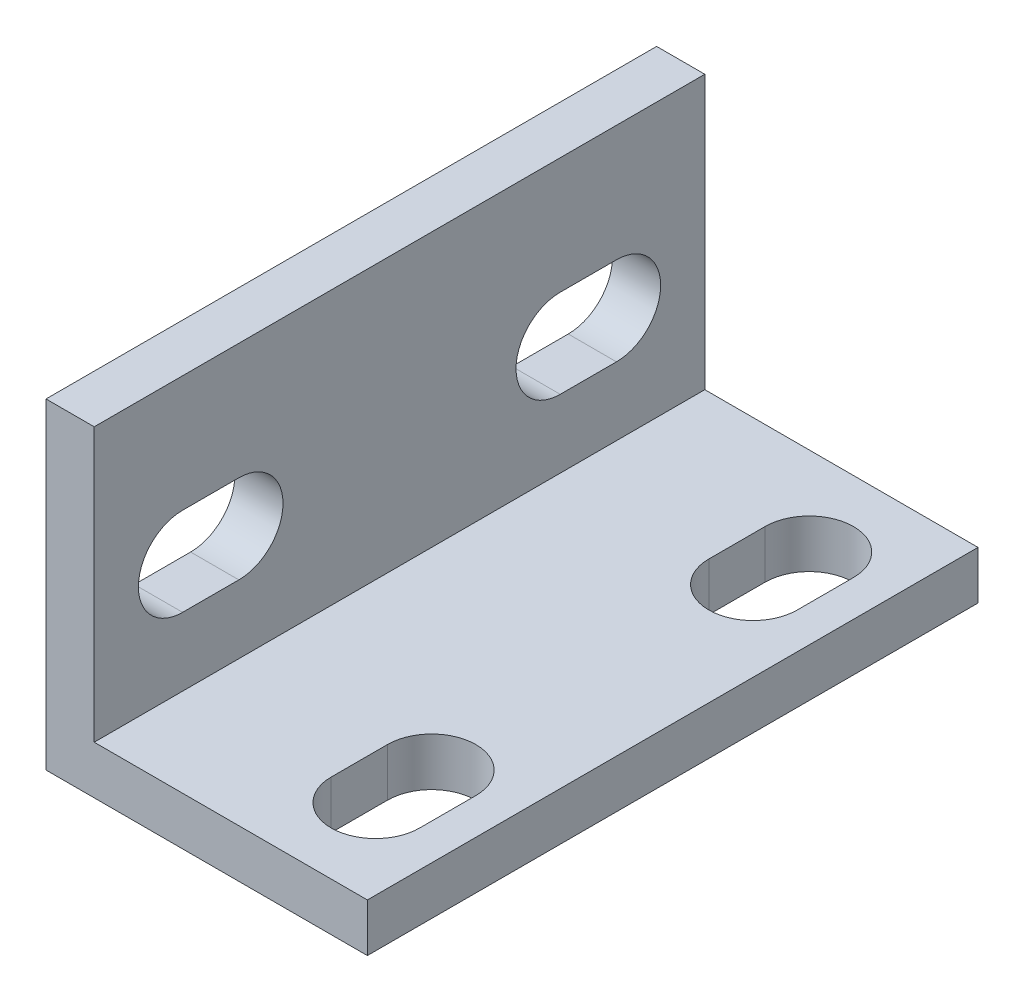
ISO-10303-21;
HEADER;
FILE_DESCRIPTION(('STEP AP214'),'2;1');
FILE_NAME('part.step','',(''),(''),'','','');
FILE_SCHEMA(('AUTOMOTIVE_DESIGN { 1 0 10303 214 1 1 1 1 }'));
ENDSEC;
DATA;
#1=APPLICATION_CONTEXT('core data for automotive mechanical design processes');
#2=APPLICATION_PROTOCOL_DEFINITION('international standard','automotive_design',2000,#1);
#3=PRODUCT_CONTEXT('',#1,'mechanical');
#4=PRODUCT('Part','Part','',(#3));
#5=PRODUCT_RELATED_PRODUCT_CATEGORY('part','',(#4));
#6=PRODUCT_DEFINITION_FORMATION('','',#4);
#7=PRODUCT_DEFINITION_CONTEXT('part definition',#1,'design');
#8=PRODUCT_DEFINITION('design','',#6,#7);
#9=PRODUCT_DEFINITION_SHAPE('','',#8);
#10=(LENGTH_UNIT() NAMED_UNIT(*) SI_UNIT(.MILLI.,.METRE.));
#11=(NAMED_UNIT(*) PLANE_ANGLE_UNIT() SI_UNIT($,.RADIAN.));
#12=(NAMED_UNIT(*) SI_UNIT($,.STERADIAN.) SOLID_ANGLE_UNIT());
#13=UNCERTAINTY_MEASURE_WITH_UNIT(LENGTH_MEASURE(1.E-05),#10,'distance_accuracy_value','');
#14=(GEOMETRIC_REPRESENTATION_CONTEXT(3) GLOBAL_UNCERTAINTY_ASSIGNED_CONTEXT((#13)) GLOBAL_UNIT_ASSIGNED_CONTEXT((#10,
#11,#12)) REPRESENTATION_CONTEXT('',''));
#15=CARTESIAN_POINT('',(0.,0.,0.));
#16=DIRECTION('',(0.,0.,1.));
#17=DIRECTION('',(1.,0.,0.));
#18=AXIS2_PLACEMENT_3D('',#15,#16,#17);
#19=CARTESIAN_POINT('',(0.,0.,38.));
#20=DIRECTION('',(0.,1.,0.));
#21=DIRECTION('',(0.,0.,1.));
#22=AXIS2_PLACEMENT_3D('',#19,#20,#21);
#23=PLANE('',#22);
#24=DIRECTION('',(0.,0.,-1.));
#25=VECTOR('',#24,1.);
#26=CARTESIAN_POINT('',(17.75,0.,5.49999999999999));
#27=LINE('',#26,#25);
#28=CARTESIAN_POINT('',(17.75,0.,9.));
#29=VERTEX_POINT('',#28);
#30=CARTESIAN_POINT('',(17.75,0.,5.49999999999999));
#31=VERTEX_POINT('',#30);
#32=EDGE_CURVE('E190',#29,#31,#27,.T.);
#33=ORIENTED_EDGE('',*,*,#32,.T.);
#34=CARTESIAN_POINT('',(15.,0.,5.49999999999999));
#35=DIRECTION('',(0.,1.,0.));
#36=DIRECTION('',(0.,0.,-1.));
#37=AXIS2_PLACEMENT_3D('',#34,#35,#36);
#38=CIRCLE('',#37,2.75000000000001);
#39=CARTESIAN_POINT('',(12.25,0.,5.49999999999999));
#40=VERTEX_POINT('',#39);
#41=EDGE_CURVE('E184',#31,#40,#38,.T.);
#42=ORIENTED_EDGE('',*,*,#41,.T.);
#43=DIRECTION('',(0.,0.,1.));
#44=VECTOR('',#43,1.);
#45=CARTESIAN_POINT('',(12.25,0.,5.49999999999999));
#46=LINE('',#45,#44);
#47=CARTESIAN_POINT('',(12.25,0.,9.));
#48=VERTEX_POINT('',#47);
#49=EDGE_CURVE('E193',#40,#48,#46,.T.);
#50=ORIENTED_EDGE('',*,*,#49,.T.);
#51=CARTESIAN_POINT('',(15.,0.,9.));
#52=DIRECTION('',(0.,1.,0.));
#53=DIRECTION('',(0.,0.,-1.));
#54=AXIS2_PLACEMENT_3D('',#51,#52,#53);
#55=CIRCLE('',#54,2.75000000000001);
#56=EDGE_CURVE('E49',#48,#29,#55,.T.);
#57=ORIENTED_EDGE('',*,*,#56,.T.);
#58=EDGE_LOOP('',(#33,#42,#50,#57));
#59=FACE_BOUND('',#58,.T.);
#60=DIRECTION('',(0.,0.,1.));
#61=VECTOR('',#60,1.);
#62=CARTESIAN_POINT('',(12.25,0.,32.5));
#63=LINE('',#62,#61);
#64=CARTESIAN_POINT('',(12.25,0.,29.));
#65=VERTEX_POINT('',#64);
#66=CARTESIAN_POINT('',(12.25,0.,32.5));
#67=VERTEX_POINT('',#66);
#68=EDGE_CURVE('E228',#65,#67,#63,.T.);
#69=ORIENTED_EDGE('',*,*,#68,.T.);
#70=CARTESIAN_POINT('',(15.,0.,32.5));
#71=DIRECTION('',(0.,1.,0.));
#72=DIRECTION('',(0.,0.,1.));
#73=AXIS2_PLACEMENT_3D('',#70,#71,#72);
#74=CIRCLE('',#73,2.75);
#75=CARTESIAN_POINT('',(17.75,0.,32.5));
#76=VERTEX_POINT('',#75);
#77=EDGE_CURVE('E218',#67,#76,#74,.T.);
#78=ORIENTED_EDGE('',*,*,#77,.T.);
#79=DIRECTION('',(0.,0.,-1.));
#80=VECTOR('',#79,1.);
#81=CARTESIAN_POINT('',(17.75,0.,32.5));
#82=LINE('',#81,#80);
#83=CARTESIAN_POINT('',(17.75,0.,29.));
#84=VERTEX_POINT('',#83);
#85=EDGE_CURVE('E221',#76,#84,#82,.T.);
#86=ORIENTED_EDGE('',*,*,#85,.T.);
#87=CARTESIAN_POINT('',(15.,0.,29.));
#88=DIRECTION('',(0.,1.,0.));
#89=DIRECTION('',(0.,0.,1.));
#90=AXIS2_PLACEMENT_3D('',#87,#88,#89);
#91=CIRCLE('',#90,2.75000000000001);
#92=EDGE_CURVE('E225',#84,#65,#91,.T.);
#93=ORIENTED_EDGE('',*,*,#92,.T.);
#94=EDGE_LOOP('',(#69,#78,#86,#93));
#95=FACE_BOUND('',#94,.T.);
#96=DIRECTION('',(1.,0.,0.));
#97=VECTOR('',#96,1.);
#98=CARTESIAN_POINT('',(0.,0.,0.));
#99=LINE('',#98,#97);
#100=CARTESIAN_POINT('',(0.,0.,0.));
#101=VERTEX_POINT('',#100);
#102=CARTESIAN_POINT('',(20.,0.,0.));
#103=VERTEX_POINT('',#102);
#104=EDGE_CURVE('E307',#101,#103,#99,.T.);
#105=ORIENTED_EDGE('',*,*,#104,.T.);
#106=DIRECTION('',(0.,0.,-1.));
#107=VECTOR('',#106,1.);
#108=CARTESIAN_POINT('',(20.,0.,38.));
#109=LINE('',#108,#107);
#110=CARTESIAN_POINT('',(20.,0.,38.));
#111=VERTEX_POINT('',#110);
#112=EDGE_CURVE('E11',#111,#103,#109,.T.);
#113=ORIENTED_EDGE('',*,*,#112,.F.);
#114=DIRECTION('',(1.,0.,0.));
#115=VECTOR('',#114,1.);
#116=CARTESIAN_POINT('',(0.,0.,38.));
#117=LINE('',#116,#115);
#118=CARTESIAN_POINT('',(0.,0.,38.));
#119=VERTEX_POINT('',#118);
#120=EDGE_CURVE('E314',#119,#111,#117,.T.);
#121=ORIENTED_EDGE('',*,*,#120,.F.);
#122=DIRECTION('',(0.,0.,-1.));
#123=VECTOR('',#122,1.);
#124=CARTESIAN_POINT('',(0.,0.,38.));
#125=LINE('',#124,#123);
#126=EDGE_CURVE('E331',#119,#101,#125,.T.);
#127=ORIENTED_EDGE('',*,*,#126,.T.);
#128=EDGE_LOOP('',(#105,#113,#121,#127));
#129=FACE_BOUND('',#128,.T.);
#130=ADVANCED_FACE('F35',(#59,#95,#129),#23,.F.);
#131=CARTESIAN_POINT('',(20.,3.,38.));
#132=DIRECTION('',(1.,0.,0.));
#133=DIRECTION('',(0.,0.,-1.));
#134=AXIS2_PLACEMENT_3D('',#131,#132,#133);
#135=PLANE('',#134);
#136=DIRECTION('',(0.,-1.,0.));
#137=VECTOR('',#136,1.);
#138=CARTESIAN_POINT('',(20.,3.,0.));
#139=LINE('',#138,#137);
#140=CARTESIAN_POINT('',(20.,3.,0.));
#141=VERTEX_POINT('',#140);
#142=EDGE_CURVE('E334',#141,#103,#139,.T.);
#143=ORIENTED_EDGE('',*,*,#142,.F.);
#144=DIRECTION('',(0.,0.,-1.));
#145=VECTOR('',#144,1.);
#146=CARTESIAN_POINT('',(20.,3.,38.));
#147=LINE('',#146,#145);
#148=CARTESIAN_POINT('',(20.,3.,38.));
#149=VERTEX_POINT('',#148);
#150=EDGE_CURVE('E42',#149,#141,#147,.T.);
#151=ORIENTED_EDGE('',*,*,#150,.F.);
#152=DIRECTION('',(0.,-1.,0.));
#153=VECTOR('',#152,1.);
#154=CARTESIAN_POINT('',(20.,3.,38.));
#155=LINE('',#154,#153);
#156=EDGE_CURVE('E316',#149,#111,#155,.T.);
#157=ORIENTED_EDGE('',*,*,#156,.T.);
#158=ORIENTED_EDGE('',*,*,#112,.T.);
#159=EDGE_LOOP('',(#143,#151,#157,#158));
#160=FACE_BOUND('',#159,.T.);
#161=ADVANCED_FACE('F361',(#160),#135,.T.);
#162=CARTESIAN_POINT('',(0.,3.,38.));
#163=DIRECTION('',(0.,1.,0.));
#164=DIRECTION('',(0.,0.,1.));
#165=AXIS2_PLACEMENT_3D('',#162,#163,#164);
#166=PLANE('',#165);
#167=CARTESIAN_POINT('',(15.,3.,5.49999999999999));
#168=DIRECTION('',(0.,1.,0.));
#169=DIRECTION('',(0.,0.,-1.));
#170=AXIS2_PLACEMENT_3D('',#167,#168,#169);
#171=CIRCLE('',#170,2.75000000000001);
#172=CARTESIAN_POINT('',(17.75,3.,5.49999999999999));
#173=VERTEX_POINT('',#172);
#174=CARTESIAN_POINT('',(12.25,3.,5.5));
#175=VERTEX_POINT('',#174);
#176=EDGE_CURVE('E57',#173,#175,#171,.T.);
#177=ORIENTED_EDGE('',*,*,#176,.F.);
#178=DIRECTION('',(0.,0.,-1.));
#179=VECTOR('',#178,1.);
#180=CARTESIAN_POINT('',(17.75,3.,5.49999999999999));
#181=LINE('',#180,#179);
#182=CARTESIAN_POINT('',(17.75,3.,9.));
#183=VERTEX_POINT('',#182);
#184=EDGE_CURVE('E199',#183,#173,#181,.T.);
#185=ORIENTED_EDGE('',*,*,#184,.F.);
#186=CARTESIAN_POINT('',(15.,3.,9.));
#187=DIRECTION('',(0.,1.,0.));
#188=DIRECTION('',(0.,0.,-1.));
#189=AXIS2_PLACEMENT_3D('',#186,#187,#188);
#190=CIRCLE('',#189,2.75000000000001);
#191=CARTESIAN_POINT('',(12.25,3.,9.));
#192=VERTEX_POINT('',#191);
#193=EDGE_CURVE('E202',#192,#183,#190,.T.);
#194=ORIENTED_EDGE('',*,*,#193,.F.);
#195=DIRECTION('',(0.,0.,1.));
#196=VECTOR('',#195,1.);
#197=CARTESIAN_POINT('',(12.25,3.,5.49999999999999));
#198=LINE('',#197,#196);
#199=EDGE_CURVE('E208',#175,#192,#198,.T.);
#200=ORIENTED_EDGE('',*,*,#199,.F.);
#201=EDGE_LOOP('',(#177,#185,#194,#200));
#202=FACE_BOUND('',#201,.T.);
#203=CARTESIAN_POINT('',(15.,3.,32.5));
#204=DIRECTION('',(0.,1.,0.));
#205=DIRECTION('',(0.,0.,1.));
#206=AXIS2_PLACEMENT_3D('',#203,#204,#205);
#207=CIRCLE('',#206,2.75);
#208=CARTESIAN_POINT('',(12.25,3.,32.5));
#209=VERTEX_POINT('',#208);
#210=CARTESIAN_POINT('',(17.75,3.,32.5));
#211=VERTEX_POINT('',#210);
#212=EDGE_CURVE('E214',#209,#211,#207,.T.);
#213=ORIENTED_EDGE('',*,*,#212,.F.);
#214=DIRECTION('',(0.,0.,1.));
#215=VECTOR('',#214,1.);
#216=CARTESIAN_POINT('',(12.25,3.,32.5));
#217=LINE('',#216,#215);
#218=CARTESIAN_POINT('',(12.25,3.,29.));
#219=VERTEX_POINT('',#218);
#220=EDGE_CURVE('E222',#219,#209,#217,.T.);
#221=ORIENTED_EDGE('',*,*,#220,.F.);
#222=CARTESIAN_POINT('',(15.,3.,29.));
#223=DIRECTION('',(0.,1.,0.));
#224=DIRECTION('',(0.,0.,1.));
#225=AXIS2_PLACEMENT_3D('',#222,#223,#224);
#226=CIRCLE('',#225,2.75000000000001);
#227=CARTESIAN_POINT('',(17.75,3.,29.));
#228=VERTEX_POINT('',#227);
#229=EDGE_CURVE('E236',#228,#219,#226,.T.);
#230=ORIENTED_EDGE('',*,*,#229,.F.);
#231=DIRECTION('',(0.,0.,-1.));
#232=VECTOR('',#231,1.);
#233=CARTESIAN_POINT('',(17.75,3.,32.5));
#234=LINE('',#233,#232);
#235=EDGE_CURVE('E233',#211,#228,#234,.T.);
#236=ORIENTED_EDGE('',*,*,#235,.F.);
#237=EDGE_LOOP('',(#213,#221,#230,#236));
#238=FACE_BOUND('',#237,.T.);
#239=DIRECTION('',(1.,0.,0.));
#240=VECTOR('',#239,1.);
#241=CARTESIAN_POINT('',(0.,3.,0.));
#242=LINE('',#241,#240);
#243=CARTESIAN_POINT('',(3.,3.,0.));
#244=VERTEX_POINT('',#243);
#245=EDGE_CURVE('E337',#244,#141,#242,.T.);
#246=ORIENTED_EDGE('',*,*,#245,.F.);
#247=DIRECTION('',(0.,0.,-1.));
#248=VECTOR('',#247,1.);
#249=CARTESIAN_POINT('',(3.,3.,38.));
#250=LINE('',#249,#248);
#251=CARTESIAN_POINT('',(3.,3.,38.));
#252=VERTEX_POINT('',#251);
#253=EDGE_CURVE('E353',#252,#244,#250,.T.);
#254=ORIENTED_EDGE('',*,*,#253,.F.);
#255=DIRECTION('',(1.,0.,0.));
#256=VECTOR('',#255,1.);
#257=CARTESIAN_POINT('',(0.,3.,38.));
#258=LINE('',#257,#256);
#259=EDGE_CURVE('E320',#252,#149,#258,.T.);
#260=ORIENTED_EDGE('',*,*,#259,.T.);
#261=ORIENTED_EDGE('',*,*,#150,.T.);
#262=EDGE_LOOP('',(#246,#254,#260,#261));
#263=FACE_BOUND('',#262,.T.);
#264=ADVANCED_FACE('F357',(#202,#238,#263),#166,.T.);
#265=CARTESIAN_POINT('',(3.,20.,38.));
#266=DIRECTION('',(1.,0.,0.));
#267=DIRECTION('',(0.,0.,-1.));
#268=AXIS2_PLACEMENT_3D('',#265,#266,#267);
#269=PLANE('',#268);
#270=CARTESIAN_POINT('',(3.,10.,9.00000000000001));
#271=DIRECTION('',(1.,0.,0.));
#272=DIRECTION('',(0.,0.,1.));
#273=AXIS2_PLACEMENT_3D('',#270,#271,#272);
#274=CIRCLE('',#273,2.75);
#275=CARTESIAN_POINT('',(3.,12.75,9.00000000000001));
#276=VERTEX_POINT('',#275);
#277=CARTESIAN_POINT('',(3.,7.25,9.));
#278=VERTEX_POINT('',#277);
#279=EDGE_CURVE('E243',#276,#278,#274,.T.);
#280=ORIENTED_EDGE('',*,*,#279,.F.);
#281=DIRECTION('',(0.,0.,1.));
#282=VECTOR('',#281,1.);
#283=CARTESIAN_POINT('',(3.,12.75,9.00000000000001));
#284=LINE('',#283,#282);
#285=CARTESIAN_POINT('',(3.,12.75,5.5));
#286=VERTEX_POINT('',#285);
#287=EDGE_CURVE('E254',#286,#276,#284,.T.);
#288=ORIENTED_EDGE('',*,*,#287,.F.);
#289=CARTESIAN_POINT('',(3.,10.,5.5));
#290=DIRECTION('',(1.,0.,0.));
#291=DIRECTION('',(0.,0.,1.));
#292=AXIS2_PLACEMENT_3D('',#289,#290,#291);
#293=CIRCLE('',#292,2.75);
#294=CARTESIAN_POINT('',(3.,7.25,5.5));
#295=VERTEX_POINT('',#294);
#296=EDGE_CURVE('E268',#295,#286,#293,.T.);
#297=ORIENTED_EDGE('',*,*,#296,.F.);
#298=DIRECTION('',(0.,0.,-1.));
#299=VECTOR('',#298,1.);
#300=CARTESIAN_POINT('',(3.,7.25,9.00000000000001));
#301=LINE('',#300,#299);
#302=EDGE_CURVE('E265',#278,#295,#301,.T.);
#303=ORIENTED_EDGE('',*,*,#302,.F.);
#304=EDGE_LOOP('',(#280,#288,#297,#303));
#305=FACE_BOUND('',#304,.T.);
#306=CARTESIAN_POINT('',(3.,10.,29.));
#307=DIRECTION('',(1.,0.,0.));
#308=DIRECTION('',(0.,0.,-1.));
#309=AXIS2_PLACEMENT_3D('',#306,#307,#308);
#310=CIRCLE('',#309,2.75);
#311=CARTESIAN_POINT('',(3.,7.25,29.));
#312=VERTEX_POINT('',#311);
#313=CARTESIAN_POINT('',(3.,12.75,29.));
#314=VERTEX_POINT('',#313);
#315=EDGE_CURVE('E275',#312,#314,#310,.T.);
#316=ORIENTED_EDGE('',*,*,#315,.F.);
#317=DIRECTION('',(0.,0.,-1.));
#318=VECTOR('',#317,1.);
#319=CARTESIAN_POINT('',(3.,7.25,29.));
#320=LINE('',#319,#318);
#321=CARTESIAN_POINT('',(3.,7.25,32.5));
#322=VERTEX_POINT('',#321);
#323=EDGE_CURVE('E286',#322,#312,#320,.T.);
#324=ORIENTED_EDGE('',*,*,#323,.F.);
#325=CARTESIAN_POINT('',(3.,10.,32.5));
#326=DIRECTION('',(1.,0.,0.));
#327=DIRECTION('',(0.,0.,-1.));
#328=AXIS2_PLACEMENT_3D('',#325,#326,#327);
#329=CIRCLE('',#328,2.75);
#330=CARTESIAN_POINT('',(3.,12.75,32.5));
#331=VERTEX_POINT('',#330);
#332=EDGE_CURVE('E300',#331,#322,#329,.T.);
#333=ORIENTED_EDGE('',*,*,#332,.F.);
#334=DIRECTION('',(0.,0.,1.));
#335=VECTOR('',#334,1.);
#336=CARTESIAN_POINT('',(3.,12.75,29.));
#337=LINE('',#336,#335);
#338=EDGE_CURVE('E297',#314,#331,#337,.T.);
#339=ORIENTED_EDGE('',*,*,#338,.F.);
#340=EDGE_LOOP('',(#316,#324,#333,#339));
#341=FACE_BOUND('',#340,.T.);
#342=DIRECTION('',(0.,1.,0.));
#343=VECTOR('',#342,1.);
#344=CARTESIAN_POINT('',(3.,20.,0.));
#345=LINE('',#344,#343);
#346=CARTESIAN_POINT('',(3.,20.,0.));
#347=VERTEX_POINT('',#346);
#348=EDGE_CURVE('E340',#347,#244,#345,.F.);
#349=ORIENTED_EDGE('',*,*,#348,.F.);
#350=DIRECTION('',(0.,0.,-1.));
#351=VECTOR('',#350,1.);
#352=CARTESIAN_POINT('',(3.,20.,38.));
#353=LINE('',#352,#351);
#354=CARTESIAN_POINT('',(3.,20.,38.));
#355=VERTEX_POINT('',#354);
#356=EDGE_CURVE('E351',#355,#347,#353,.T.);
#357=ORIENTED_EDGE('',*,*,#356,.F.);
#358=DIRECTION('',(0.,1.,0.));
#359=VECTOR('',#358,1.);
#360=CARTESIAN_POINT('',(3.,20.,38.));
#361=LINE('',#360,#359);
#362=EDGE_CURVE('E323',#355,#252,#361,.F.);
#363=ORIENTED_EDGE('',*,*,#362,.T.);
#364=ORIENTED_EDGE('',*,*,#253,.T.);
#365=EDGE_LOOP('',(#349,#357,#363,#364));
#366=FACE_BOUND('',#365,.T.);
#367=ADVANCED_FACE('F370',(#305,#341,#366),#269,.T.);
#368=CARTESIAN_POINT('',(0.,20.,38.));
#369=DIRECTION('',(0.,1.,0.));
#370=DIRECTION('',(0.,0.,1.));
#371=AXIS2_PLACEMENT_3D('',#368,#369,#370);
#372=PLANE('',#371);
#373=DIRECTION('',(1.,0.,0.));
#374=VECTOR('',#373,1.);
#375=CARTESIAN_POINT('',(0.,20.,0.));
#376=LINE('',#375,#374);
#377=CARTESIAN_POINT('',(0.,20.,0.));
#378=VERTEX_POINT('',#377);
#379=EDGE_CURVE('E343',#378,#347,#376,.T.);
#380=ORIENTED_EDGE('',*,*,#379,.F.);
#381=DIRECTION('',(0.,0.,-1.));
#382=VECTOR('',#381,1.);
#383=CARTESIAN_POINT('',(0.,20.,38.));
#384=LINE('',#383,#382);
#385=CARTESIAN_POINT('',(0.,20.,38.));
#386=VERTEX_POINT('',#385);
#387=EDGE_CURVE('E349',#386,#378,#384,.T.);
#388=ORIENTED_EDGE('',*,*,#387,.F.);
#389=DIRECTION('',(1.,0.,0.));
#390=VECTOR('',#389,1.);
#391=CARTESIAN_POINT('',(0.,20.,38.));
#392=LINE('',#391,#390);
#393=EDGE_CURVE('E326',#386,#355,#392,.T.);
#394=ORIENTED_EDGE('',*,*,#393,.T.);
#395=ORIENTED_EDGE('',*,*,#356,.T.);
#396=EDGE_LOOP('',(#380,#388,#394,#395));
#397=FACE_BOUND('',#396,.T.);
#398=ADVANCED_FACE('F381',(#397),#372,.T.);
#399=CARTESIAN_POINT('',(0.,20.,38.));
#400=DIRECTION('',(1.,0.,0.));
#401=DIRECTION('',(0.,0.,-1.));
#402=AXIS2_PLACEMENT_3D('',#399,#400,#401);
#403=PLANE('',#402);
#404=DIRECTION('',(0.,0.,1.));
#405=VECTOR('',#404,1.);
#406=CARTESIAN_POINT('',(0.,12.75,9.00000000000001));
#407=LINE('',#406,#405);
#408=CARTESIAN_POINT('',(0.,12.75,5.5));
#409=VERTEX_POINT('',#408);
#410=CARTESIAN_POINT('',(0.,12.75,9.00000000000001));
#411=VERTEX_POINT('',#410);
#412=EDGE_CURVE('E260',#409,#411,#407,.T.);
#413=ORIENTED_EDGE('',*,*,#412,.T.);
#414=CARTESIAN_POINT('',(0.,10.,9.00000000000001));
#415=DIRECTION('',(1.,0.,0.));
#416=DIRECTION('',(0.,0.,1.));
#417=AXIS2_PLACEMENT_3D('',#414,#415,#416);
#418=CIRCLE('',#417,2.75);
#419=CARTESIAN_POINT('',(0.,7.25,9.00000000000001));
#420=VERTEX_POINT('',#419);
#421=EDGE_CURVE('E250',#411,#420,#418,.T.);
#422=ORIENTED_EDGE('',*,*,#421,.T.);
#423=DIRECTION('',(0.,0.,-1.));
#424=VECTOR('',#423,1.);
#425=CARTESIAN_POINT('',(0.,7.25,9.00000000000001));
#426=LINE('',#425,#424);
#427=CARTESIAN_POINT('',(0.,7.25,5.50000000000001));
#428=VERTEX_POINT('',#427);
#429=EDGE_CURVE('E253',#420,#428,#426,.T.);
#430=ORIENTED_EDGE('',*,*,#429,.T.);
#431=CARTESIAN_POINT('',(0.,10.,5.5));
#432=DIRECTION('',(1.,0.,0.));
#433=DIRECTION('',(0.,0.,1.));
#434=AXIS2_PLACEMENT_3D('',#431,#432,#433);
#435=CIRCLE('',#434,2.75);
#436=EDGE_CURVE('E257',#428,#409,#435,.T.);
#437=ORIENTED_EDGE('',*,*,#436,.T.);
#438=EDGE_LOOP('',(#413,#422,#430,#437));
#439=FACE_BOUND('',#438,.T.);
#440=DIRECTION('',(0.,0.,-1.));
#441=VECTOR('',#440,1.);
#442=CARTESIAN_POINT('',(0.,7.25,29.));
#443=LINE('',#442,#441);
#444=CARTESIAN_POINT('',(0.,7.25,32.5));
#445=VERTEX_POINT('',#444);
#446=CARTESIAN_POINT('',(0.,7.25,29.));
#447=VERTEX_POINT('',#446);
#448=EDGE_CURVE('E292',#445,#447,#443,.T.);
#449=ORIENTED_EDGE('',*,*,#448,.T.);
#450=CARTESIAN_POINT('',(0.,10.,29.));
#451=DIRECTION('',(1.,0.,0.));
#452=DIRECTION('',(0.,0.,-1.));
#453=AXIS2_PLACEMENT_3D('',#450,#451,#452);
#454=CIRCLE('',#453,2.75);
#455=CARTESIAN_POINT('',(0.,12.75,29.));
#456=VERTEX_POINT('',#455);
#457=EDGE_CURVE('E282',#447,#456,#454,.T.);
#458=ORIENTED_EDGE('',*,*,#457,.T.);
#459=DIRECTION('',(0.,0.,1.));
#460=VECTOR('',#459,1.);
#461=CARTESIAN_POINT('',(0.,12.75,29.));
#462=LINE('',#461,#460);
#463=CARTESIAN_POINT('',(0.,12.75,32.5));
#464=VERTEX_POINT('',#463);
#465=EDGE_CURVE('E285',#456,#464,#462,.T.);
#466=ORIENTED_EDGE('',*,*,#465,.T.);
#467=CARTESIAN_POINT('',(0.,10.,32.5));
#468=DIRECTION('',(1.,0.,0.));
#469=DIRECTION('',(0.,0.,-1.));
#470=AXIS2_PLACEMENT_3D('',#467,#468,#469);
#471=CIRCLE('',#470,2.75);
#472=EDGE_CURVE('E289',#464,#445,#471,.T.);
#473=ORIENTED_EDGE('',*,*,#472,.T.);
#474=EDGE_LOOP('',(#449,#458,#466,#473));
#475=FACE_BOUND('',#474,.T.);
#476=DIRECTION('',(0.,-1.,0.));
#477=VECTOR('',#476,1.);
#478=CARTESIAN_POINT('',(0.,20.,0.));
#479=LINE('',#478,#477);
#480=EDGE_CURVE('E317',#378,#101,#479,.T.);
#481=ORIENTED_EDGE('',*,*,#480,.T.);
#482=ORIENTED_EDGE('',*,*,#126,.F.);
#483=DIRECTION('',(0.,-1.,0.));
#484=VECTOR('',#483,1.);
#485=CARTESIAN_POINT('',(0.,20.,38.));
#486=LINE('',#485,#484);
#487=EDGE_CURVE('E329',#386,#119,#486,.T.);
#488=ORIENTED_EDGE('',*,*,#487,.F.);
#489=ORIENTED_EDGE('',*,*,#387,.T.);
#490=EDGE_LOOP('',(#481,#482,#488,#489));
#491=FACE_BOUND('',#490,.T.);
#492=ADVANCED_FACE('F382',(#439,#475,#491),#403,.F.);
#493=CARTESIAN_POINT('',(0.,0.,38.));
#494=DIRECTION('',(0.,0.,-1.));
#495=DIRECTION('',(-1.,0.,0.));
#496=AXIS2_PLACEMENT_3D('',#493,#494,#495);
#497=PLANE('',#496);
#498=ORIENTED_EDGE('',*,*,#120,.T.);
#499=ORIENTED_EDGE('',*,*,#156,.F.);
#500=ORIENTED_EDGE('',*,*,#259,.F.);
#501=ORIENTED_EDGE('',*,*,#362,.F.);
#502=ORIENTED_EDGE('',*,*,#393,.F.);
#503=ORIENTED_EDGE('',*,*,#487,.T.);
#504=EDGE_LOOP('',(#498,#499,#500,#501,#502,#503));
#505=FACE_BOUND('',#504,.T.);
#506=ADVANCED_FACE('F373',(#505),#497,.F.);
#507=CARTESIAN_POINT('',(0.,0.,0.));
#508=DIRECTION('',(0.,0.,-1.));
#509=DIRECTION('',(-1.,0.,0.));
#510=AXIS2_PLACEMENT_3D('',#507,#508,#509);
#511=PLANE('',#510);
#512=ORIENTED_EDGE('',*,*,#104,.F.);
#513=ORIENTED_EDGE('',*,*,#480,.F.);
#514=ORIENTED_EDGE('',*,*,#379,.T.);
#515=ORIENTED_EDGE('',*,*,#348,.T.);
#516=ORIENTED_EDGE('',*,*,#245,.T.);
#517=ORIENTED_EDGE('',*,*,#142,.T.);
#518=EDGE_LOOP('',(#512,#513,#514,#515,#516,#517));
#519=FACE_BOUND('',#518,.T.);
#520=ADVANCED_FACE('F365',(#519),#511,.T.);
#521=CARTESIAN_POINT('',(0.,10.,29.));
#522=DIRECTION('',(1.,0.,0.));
#523=DIRECTION('',(0.,0.,-1.));
#524=AXIS2_PLACEMENT_3D('',#521,#522,#523);
#525=CYLINDRICAL_SURFACE('',#524,2.75);
#526=ORIENTED_EDGE('',*,*,#315,.T.);
#527=DIRECTION('',(1.,0.,0.));
#528=VECTOR('',#527,1.);
#529=CARTESIAN_POINT('',(0.,12.75,29.));
#530=LINE('',#529,#528);
#531=EDGE_CURVE('E295',#456,#314,#530,.T.);
#532=ORIENTED_EDGE('',*,*,#531,.F.);
#533=ORIENTED_EDGE('',*,*,#457,.F.);
#534=DIRECTION('',(1.,0.,0.));
#535=VECTOR('',#534,1.);
#536=CARTESIAN_POINT('',(0.,7.25,29.));
#537=LINE('',#536,#535);
#538=EDGE_CURVE('E305',#447,#312,#537,.T.);
#539=ORIENTED_EDGE('',*,*,#538,.T.);
#540=EDGE_LOOP('',(#526,#532,#533,#539));
#541=FACE_BOUND('',#540,.T.);
#542=ADVANCED_FACE('F417',(#541),#525,.F.);
#543=CARTESIAN_POINT('',(0.,7.25,29.));
#544=DIRECTION('',(0.,-1.,0.));
#545=DIRECTION('',(0.,0.,-1.));
#546=AXIS2_PLACEMENT_3D('',#543,#544,#545);
#547=PLANE('',#546);
#548=ORIENTED_EDGE('',*,*,#323,.T.);
#549=ORIENTED_EDGE('',*,*,#538,.F.);
#550=ORIENTED_EDGE('',*,*,#448,.F.);
#551=DIRECTION('',(1.,0.,0.));
#552=VECTOR('',#551,1.);
#553=CARTESIAN_POINT('',(0.,7.25,32.5));
#554=LINE('',#553,#552);
#555=EDGE_CURVE('E308',#445,#322,#554,.T.);
#556=ORIENTED_EDGE('',*,*,#555,.T.);
#557=EDGE_LOOP('',(#548,#549,#550,#556));
#558=FACE_BOUND('',#557,.T.);
#559=ADVANCED_FACE('F425',(#558),#547,.F.);
#560=CARTESIAN_POINT('',(0.,10.,32.5));
#561=DIRECTION('',(1.,0.,0.));
#562=DIRECTION('',(0.,0.,-1.));
#563=AXIS2_PLACEMENT_3D('',#560,#561,#562);
#564=CYLINDRICAL_SURFACE('',#563,2.75);
#565=ORIENTED_EDGE('',*,*,#332,.T.);
#566=ORIENTED_EDGE('',*,*,#555,.F.);
#567=ORIENTED_EDGE('',*,*,#472,.F.);
#568=DIRECTION('',(1.,0.,0.));
#569=VECTOR('',#568,1.);
#570=CARTESIAN_POINT('',(0.,12.75,32.5));
#571=LINE('',#570,#569);
#572=EDGE_CURVE('E310',#464,#331,#571,.T.);
#573=ORIENTED_EDGE('',*,*,#572,.T.);
#574=EDGE_LOOP('',(#565,#566,#567,#573));
#575=FACE_BOUND('',#574,.T.);
#576=ADVANCED_FACE('F427',(#575),#564,.F.);
#577=CARTESIAN_POINT('',(0.,12.75,29.));
#578=DIRECTION('',(0.,1.,0.));
#579=DIRECTION('',(0.,0.,1.));
#580=AXIS2_PLACEMENT_3D('',#577,#578,#579);
#581=PLANE('',#580);
#582=ORIENTED_EDGE('',*,*,#338,.T.);
#583=ORIENTED_EDGE('',*,*,#572,.F.);
#584=ORIENTED_EDGE('',*,*,#465,.F.);
#585=ORIENTED_EDGE('',*,*,#531,.T.);
#586=EDGE_LOOP('',(#582,#583,#584,#585));
#587=FACE_BOUND('',#586,.T.);
#588=ADVANCED_FACE('F421',(#587),#581,.F.);
#589=CARTESIAN_POINT('',(0.,10.,9.00000000000001));
#590=DIRECTION('',(1.,0.,0.));
#591=DIRECTION('',(0.,0.,-1.));
#592=AXIS2_PLACEMENT_3D('',#589,#590,#591);
#593=CYLINDRICAL_SURFACE('',#592,2.75);
#594=ORIENTED_EDGE('',*,*,#279,.T.);
#595=DIRECTION('',(1.,0.,0.));
#596=VECTOR('',#595,1.);
#597=CARTESIAN_POINT('',(0.,7.25,9.00000000000001));
#598=LINE('',#597,#596);
#599=EDGE_CURVE('E263',#420,#278,#598,.T.);
#600=ORIENTED_EDGE('',*,*,#599,.F.);
#601=ORIENTED_EDGE('',*,*,#421,.F.);
#602=DIRECTION('',(1.,0.,0.));
#603=VECTOR('',#602,1.);
#604=CARTESIAN_POINT('',(0.,12.75,9.00000000000001));
#605=LINE('',#604,#603);
#606=EDGE_CURVE('E273',#411,#276,#605,.T.);
#607=ORIENTED_EDGE('',*,*,#606,.T.);
#608=EDGE_LOOP('',(#594,#600,#601,#607));
#609=FACE_BOUND('',#608,.T.);
#610=ADVANCED_FACE('F434',(#609),#593,.F.);
#611=CARTESIAN_POINT('',(0.,12.75,9.00000000000001));
#612=DIRECTION('',(0.,1.,0.));
#613=DIRECTION('',(0.,0.,1.));
#614=AXIS2_PLACEMENT_3D('',#611,#612,#613);
#615=PLANE('',#614);
#616=ORIENTED_EDGE('',*,*,#287,.T.);
#617=ORIENTED_EDGE('',*,*,#606,.F.);
#618=ORIENTED_EDGE('',*,*,#412,.F.);
#619=DIRECTION('',(1.,0.,0.));
#620=VECTOR('',#619,1.);
#621=CARTESIAN_POINT('',(0.,12.75,5.5));
#622=LINE('',#621,#620);
#623=EDGE_CURVE('E276',#409,#286,#622,.T.);
#624=ORIENTED_EDGE('',*,*,#623,.T.);
#625=EDGE_LOOP('',(#616,#617,#618,#624));
#626=FACE_BOUND('',#625,.T.);
#627=ADVANCED_FACE('F472',(#626),#615,.F.);
#628=CARTESIAN_POINT('',(0.,10.,5.5));
#629=DIRECTION('',(1.,0.,0.));
#630=DIRECTION('',(0.,0.,-1.));
#631=AXIS2_PLACEMENT_3D('',#628,#629,#630);
#632=CYLINDRICAL_SURFACE('',#631,2.75);
#633=ORIENTED_EDGE('',*,*,#296,.T.);
#634=ORIENTED_EDGE('',*,*,#623,.F.);
#635=ORIENTED_EDGE('',*,*,#436,.F.);
#636=DIRECTION('',(1.,0.,0.));
#637=VECTOR('',#636,1.);
#638=CARTESIAN_POINT('',(0.,7.25,5.5));
#639=LINE('',#638,#637);
#640=EDGE_CURVE('E278',#428,#295,#639,.T.);
#641=ORIENTED_EDGE('',*,*,#640,.T.);
#642=EDGE_LOOP('',(#633,#634,#635,#641));
#643=FACE_BOUND('',#642,.T.);
#644=ADVANCED_FACE('F481',(#643),#632,.F.);
#645=CARTESIAN_POINT('',(0.,7.25,9.00000000000001));
#646=DIRECTION('',(0.,-1.,0.));
#647=DIRECTION('',(0.,0.,-1.));
#648=AXIS2_PLACEMENT_3D('',#645,#646,#647);
#649=PLANE('',#648);
#650=ORIENTED_EDGE('',*,*,#302,.T.);
#651=ORIENTED_EDGE('',*,*,#640,.F.);
#652=ORIENTED_EDGE('',*,*,#429,.F.);
#653=ORIENTED_EDGE('',*,*,#599,.T.);
#654=EDGE_LOOP('',(#650,#651,#652,#653));
#655=FACE_BOUND('',#654,.T.);
#656=ADVANCED_FACE('F491',(#655),#649,.F.);
#657=CARTESIAN_POINT('',(15.,0.,32.5));
#658=DIRECTION('',(0.,1.,0.));
#659=DIRECTION('',(0.,0.,1.));
#660=AXIS2_PLACEMENT_3D('',#657,#658,#659);
#661=CYLINDRICAL_SURFACE('',#660,2.75);
#662=ORIENTED_EDGE('',*,*,#212,.T.);
#663=DIRECTION('',(0.,1.,0.));
#664=VECTOR('',#663,1.);
#665=CARTESIAN_POINT('',(17.75,0.,32.5));
#666=LINE('',#665,#664);
#667=EDGE_CURVE('E231',#76,#211,#666,.T.);
#668=ORIENTED_EDGE('',*,*,#667,.F.);
#669=ORIENTED_EDGE('',*,*,#77,.F.);
#670=DIRECTION('',(0.,1.,0.));
#671=VECTOR('',#670,1.);
#672=CARTESIAN_POINT('',(12.25,0.,32.5));
#673=LINE('',#672,#671);
#674=EDGE_CURVE('E241',#67,#209,#673,.T.);
#675=ORIENTED_EDGE('',*,*,#674,.T.);
#676=EDGE_LOOP('',(#662,#668,#669,#675));
#677=FACE_BOUND('',#676,.T.);
#678=ADVANCED_FACE('F500',(#677),#661,.F.);
#679=CARTESIAN_POINT('',(12.25,0.,32.5));
#680=DIRECTION('',(-1.,0.,0.));
#681=DIRECTION('',(0.,0.,1.));
#682=AXIS2_PLACEMENT_3D('',#679,#680,#681);
#683=PLANE('',#682);
#684=ORIENTED_EDGE('',*,*,#220,.T.);
#685=ORIENTED_EDGE('',*,*,#674,.F.);
#686=ORIENTED_EDGE('',*,*,#68,.F.);
#687=DIRECTION('',(0.,1.,0.));
#688=VECTOR('',#687,1.);
#689=CARTESIAN_POINT('',(12.25,0.,29.));
#690=LINE('',#689,#688);
#691=EDGE_CURVE('E244',#65,#219,#690,.T.);
#692=ORIENTED_EDGE('',*,*,#691,.T.);
#693=EDGE_LOOP('',(#684,#685,#686,#692));
#694=FACE_BOUND('',#693,.T.);
#695=ADVANCED_FACE('F523',(#694),#683,.F.);
#696=CARTESIAN_POINT('',(15.,0.,29.));
#697=DIRECTION('',(0.,1.,0.));
#698=DIRECTION('',(0.,0.,1.));
#699=AXIS2_PLACEMENT_3D('',#696,#697,#698);
#700=CYLINDRICAL_SURFACE('',#699,2.75000000000001);
#701=ORIENTED_EDGE('',*,*,#229,.T.);
#702=ORIENTED_EDGE('',*,*,#691,.F.);
#703=ORIENTED_EDGE('',*,*,#92,.F.);
#704=DIRECTION('',(0.,1.,0.));
#705=VECTOR('',#704,1.);
#706=CARTESIAN_POINT('',(17.75,0.,29.));
#707=LINE('',#706,#705);
#708=EDGE_CURVE('E246',#84,#228,#707,.T.);
#709=ORIENTED_EDGE('',*,*,#708,.T.);
#710=EDGE_LOOP('',(#701,#702,#703,#709));
#711=FACE_BOUND('',#710,.T.);
#712=ADVANCED_FACE('F533',(#711),#700,.F.);
#713=CARTESIAN_POINT('',(17.75,0.,32.5));
#714=DIRECTION('',(1.,0.,0.));
#715=DIRECTION('',(0.,0.,-1.));
#716=AXIS2_PLACEMENT_3D('',#713,#714,#715);
#717=PLANE('',#716);
#718=ORIENTED_EDGE('',*,*,#235,.T.);
#719=ORIENTED_EDGE('',*,*,#708,.F.);
#720=ORIENTED_EDGE('',*,*,#85,.F.);
#721=ORIENTED_EDGE('',*,*,#667,.T.);
#722=EDGE_LOOP('',(#718,#719,#720,#721));
#723=FACE_BOUND('',#722,.T.);
#724=ADVANCED_FACE('F543',(#723),#717,.F.);
#725=CARTESIAN_POINT('',(15.,0.,5.49999999999999));
#726=DIRECTION('',(0.,1.,0.));
#727=DIRECTION('',(0.,0.,1.));
#728=AXIS2_PLACEMENT_3D('',#725,#726,#727);
#729=CYLINDRICAL_SURFACE('',#728,2.75000000000001);
#730=ORIENTED_EDGE('',*,*,#176,.T.);
#731=DIRECTION('',(0.,1.,0.));
#732=VECTOR('',#731,1.);
#733=CARTESIAN_POINT('',(12.25,0.,5.49999999999999));
#734=LINE('',#733,#732);
#735=EDGE_CURVE('E180',#40,#175,#734,.T.);
#736=ORIENTED_EDGE('',*,*,#735,.F.);
#737=ORIENTED_EDGE('',*,*,#41,.F.);
#738=DIRECTION('',(0.,1.,0.));
#739=VECTOR('',#738,1.);
#740=CARTESIAN_POINT('',(17.75,0.,5.49999999999999));
#741=LINE('',#740,#739);
#742=EDGE_CURVE('E212',#31,#173,#741,.T.);
#743=ORIENTED_EDGE('',*,*,#742,.T.);
#744=EDGE_LOOP('',(#730,#736,#737,#743));
#745=FACE_BOUND('',#744,.T.);
#746=ADVANCED_FACE('F182',(#745),#729,.F.);
#747=CARTESIAN_POINT('',(17.75,0.,5.49999999999999));
#748=DIRECTION('',(1.,0.,0.));
#749=DIRECTION('',(0.,0.,-1.));
#750=AXIS2_PLACEMENT_3D('',#747,#748,#749);
#751=PLANE('',#750);
#752=ORIENTED_EDGE('',*,*,#184,.T.);
#753=ORIENTED_EDGE('',*,*,#742,.F.);
#754=ORIENTED_EDGE('',*,*,#32,.F.);
#755=DIRECTION('',(0.,1.,0.));
#756=VECTOR('',#755,1.);
#757=CARTESIAN_POINT('',(17.75,0.,9.));
#758=LINE('',#757,#756);
#759=EDGE_CURVE('E215',#29,#183,#758,.T.);
#760=ORIENTED_EDGE('',*,*,#759,.T.);
#761=EDGE_LOOP('',(#752,#753,#754,#760));
#762=FACE_BOUND('',#761,.T.);
#763=ADVANCED_FACE('F562',(#762),#751,.F.);
#764=CARTESIAN_POINT('',(15.,0.,9.));
#765=DIRECTION('',(0.,1.,0.));
#766=DIRECTION('',(0.,0.,1.));
#767=AXIS2_PLACEMENT_3D('',#764,#765,#766);
#768=CYLINDRICAL_SURFACE('',#767,2.75000000000001);
#769=ORIENTED_EDGE('',*,*,#193,.T.);
#770=ORIENTED_EDGE('',*,*,#759,.F.);
#771=ORIENTED_EDGE('',*,*,#56,.F.);
#772=DIRECTION('',(0.,1.,0.));
#773=VECTOR('',#772,1.);
#774=CARTESIAN_POINT('',(12.25,0.,9.));
#775=LINE('',#774,#773);
#776=EDGE_CURVE('E189',#48,#192,#775,.T.);
#777=ORIENTED_EDGE('',*,*,#776,.T.);
#778=EDGE_LOOP('',(#769,#770,#771,#777));
#779=FACE_BOUND('',#778,.T.);
#780=ADVANCED_FACE('F571',(#779),#768,.F.);
#781=CARTESIAN_POINT('',(12.25,0.,5.49999999999999));
#782=DIRECTION('',(-1.,0.,0.));
#783=DIRECTION('',(0.,0.,1.));
#784=AXIS2_PLACEMENT_3D('',#781,#782,#783);
#785=PLANE('',#784);
#786=ORIENTED_EDGE('',*,*,#199,.T.);
#787=ORIENTED_EDGE('',*,*,#776,.F.);
#788=ORIENTED_EDGE('',*,*,#49,.F.);
#789=ORIENTED_EDGE('',*,*,#735,.T.);
#790=EDGE_LOOP('',(#786,#787,#788,#789));
#791=FACE_BOUND('',#790,.T.);
#792=ADVANCED_FACE('F194',(#791),#785,.F.);
#793=CLOSED_SHELL('',(#130,#161,#264,#367,#398,#492,#506,#520,#542,#559,#576,#588,#610,#627,
#644,#656,#678,#695,#712,#724,#746,#763,#780,#792));
#794=MANIFOLD_SOLID_BREP('B2',#793);
#795=ADVANCED_BREP_SHAPE_REPRESENTATION('',(#18,#794),#14);
#796=SHAPE_DEFINITION_REPRESENTATION(#9,#795);
ENDSEC;
END-ISO-10303-21;
